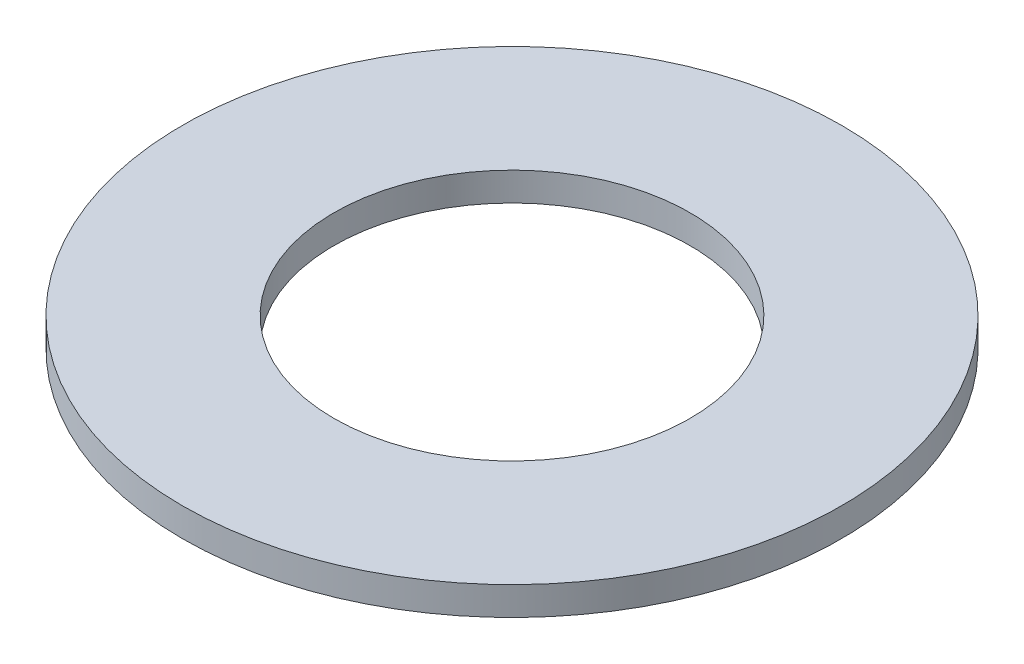
ISO-10303-21;
HEADER;
FILE_DESCRIPTION(('STEP AP214'),'2;1');
FILE_NAME('part.step','',(''),(''),'','','');
FILE_SCHEMA(('AUTOMOTIVE_DESIGN { 1 0 10303 214 1 1 1 1 }'));
ENDSEC;
DATA;
#1=APPLICATION_CONTEXT('core data for automotive mechanical design processes');
#2=APPLICATION_PROTOCOL_DEFINITION('international standard','automotive_design',2000,#1);
#3=PRODUCT_CONTEXT('',#1,'mechanical');
#4=PRODUCT('Part','Part','',(#3));
#5=PRODUCT_RELATED_PRODUCT_CATEGORY('part','',(#4));
#6=PRODUCT_DEFINITION_FORMATION('','',#4);
#7=PRODUCT_DEFINITION_CONTEXT('part definition',#1,'design');
#8=PRODUCT_DEFINITION('design','',#6,#7);
#9=PRODUCT_DEFINITION_SHAPE('','',#8);
#10=(LENGTH_UNIT() NAMED_UNIT(*) SI_UNIT(.MILLI.,.METRE.));
#11=(NAMED_UNIT(*) PLANE_ANGLE_UNIT() SI_UNIT($,.RADIAN.));
#12=(NAMED_UNIT(*) SI_UNIT($,.STERADIAN.) SOLID_ANGLE_UNIT());
#13=UNCERTAINTY_MEASURE_WITH_UNIT(LENGTH_MEASURE(1.E-05),#10,'distance_accuracy_value','');
#14=(GEOMETRIC_REPRESENTATION_CONTEXT(3) GLOBAL_UNCERTAINTY_ASSIGNED_CONTEXT((#13)) GLOBAL_UNIT_ASSIGNED_CONTEXT((#10,
#11,#12)) REPRESENTATION_CONTEXT('',''));
#15=CARTESIAN_POINT('',(0.,0.,0.));
#16=DIRECTION('',(0.,0.,1.));
#17=DIRECTION('',(1.,0.,0.));
#18=AXIS2_PLACEMENT_3D('',#15,#16,#17);
#19=CARTESIAN_POINT('',(0.,8.,0.));
#20=DIRECTION('',(0.,-1.,0.));
#21=DIRECTION('',(0.,0.,-1.));
#22=AXIS2_PLACEMENT_3D('',#19,#20,#21);
#23=CYLINDRICAL_SURFACE('',#22,92.5);
#24=CARTESIAN_POINT('',(0.,8.,0.));
#25=DIRECTION('',(0.,1.,0.));
#26=DIRECTION('',(0.,0.,1.));
#27=AXIS2_PLACEMENT_3D('',#24,#25,#26);
#28=CIRCLE('',#27,92.5);
#29=CARTESIAN_POINT('',(0.,8.,92.5));
#30=VERTEX_POINT('',#29);
#31=EDGE_CURVE('E10',#30,#30,#28,.T.);
#32=ORIENTED_EDGE('',*,*,#31,.F.);
#33=EDGE_LOOP('',(#32));
#34=FACE_BOUND('',#33,.T.);
#35=CARTESIAN_POINT('',(0.,0.,0.));
#36=DIRECTION('',(0.,1.,0.));
#37=DIRECTION('',(0.,0.,1.));
#38=AXIS2_PLACEMENT_3D('',#35,#36,#37);
#39=CIRCLE('',#38,92.5);
#40=CARTESIAN_POINT('',(0.,0.,92.5));
#41=VERTEX_POINT('',#40);
#42=EDGE_CURVE('E37',#41,#41,#39,.T.);
#43=ORIENTED_EDGE('',*,*,#42,.T.);
#44=EDGE_LOOP('',(#43));
#45=FACE_BOUND('',#44,.T.);
#46=ADVANCED_FACE('F40',(#34,#45),#23,.T.);
#47=CARTESIAN_POINT('',(0.,8.,0.));
#48=DIRECTION('',(0.,1.,0.));
#49=DIRECTION('',(0.,0.,1.));
#50=AXIS2_PLACEMENT_3D('',#47,#48,#49);
#51=PLANE('',#50);
#52=CARTESIAN_POINT('',(0.,8.,0.));
#53=DIRECTION('',(0.,1.,0.));
#54=DIRECTION('',(0.,0.,1.));
#55=AXIS2_PLACEMENT_3D('',#52,#53,#54);
#56=CIRCLE('',#55,50.);
#57=CARTESIAN_POINT('',(0.,8.,50.));
#58=VERTEX_POINT('',#57);
#59=EDGE_CURVE('E50',#58,#58,#56,.T.);
#60=ORIENTED_EDGE('',*,*,#59,.F.);
#61=EDGE_LOOP('',(#60));
#62=FACE_BOUND('',#61,.T.);
#63=ORIENTED_EDGE('',*,*,#31,.T.);
#64=EDGE_LOOP('',(#63));
#65=FACE_BOUND('',#64,.T.);
#66=ADVANCED_FACE('F59',(#62,#65),#51,.T.);
#67=CARTESIAN_POINT('',(0.,0.,0.));
#68=DIRECTION('',(0.,1.,0.));
#69=DIRECTION('',(0.,0.,1.));
#70=AXIS2_PLACEMENT_3D('',#67,#68,#69);
#71=PLANE('',#70);
#72=CARTESIAN_POINT('',(0.,0.,0.));
#73=DIRECTION('',(0.,1.,0.));
#74=DIRECTION('',(0.,0.,1.));
#75=AXIS2_PLACEMENT_3D('',#72,#73,#74);
#76=CIRCLE('',#75,50.);
#77=CARTESIAN_POINT('',(0.,0.,50.));
#78=VERTEX_POINT('',#77);
#79=EDGE_CURVE('E47',#78,#78,#76,.T.);
#80=ORIENTED_EDGE('',*,*,#79,.T.);
#81=EDGE_LOOP('',(#80));
#82=FACE_BOUND('',#81,.T.);
#83=ORIENTED_EDGE('',*,*,#42,.F.);
#84=EDGE_LOOP('',(#83));
#85=FACE_BOUND('',#84,.T.);
#86=ADVANCED_FACE('F58',(#82,#85),#71,.F.);
#87=CARTESIAN_POINT('',(0.,8.,0.));
#88=DIRECTION('',(0.,-1.,0.));
#89=DIRECTION('',(0.,0.,-1.));
#90=AXIS2_PLACEMENT_3D('',#87,#88,#89);
#91=CYLINDRICAL_SURFACE('',#90,50.);
#92=ORIENTED_EDGE('',*,*,#59,.T.);
#93=EDGE_LOOP('',(#92));
#94=FACE_BOUND('',#93,.T.);
#95=ORIENTED_EDGE('',*,*,#79,.F.);
#96=EDGE_LOOP('',(#95));
#97=FACE_BOUND('',#96,.T.);
#98=ADVANCED_FACE('F54',(#94,#97),#91,.F.);
#99=CLOSED_SHELL('',(#46,#66,#86,#98));
#100=MANIFOLD_SOLID_BREP('B2',#99);
#101=ADVANCED_BREP_SHAPE_REPRESENTATION('',(#18,#100),#14);
#102=SHAPE_DEFINITION_REPRESENTATION(#9,#101);
ENDSEC;
END-ISO-10303-21;
